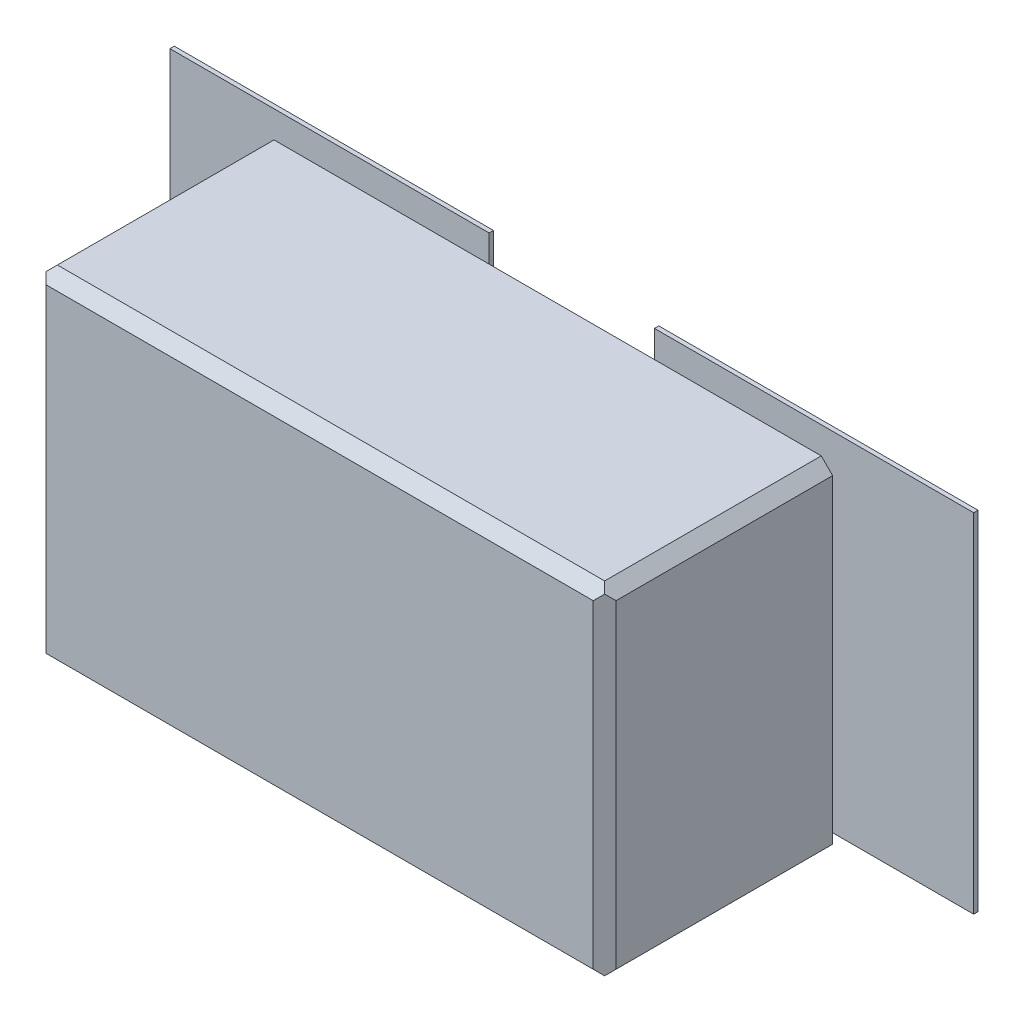
ISO-10303-21;
HEADER;
FILE_DESCRIPTION(('STEP AP214'),'2;1');
FILE_NAME('part.step','',(''),(''),'','','');
FILE_SCHEMA(('AUTOMOTIVE_DESIGN { 1 0 10303 214 1 1 1 1 }'));
ENDSEC;
DATA;
#1=APPLICATION_CONTEXT('core data for automotive mechanical design processes');
#2=APPLICATION_PROTOCOL_DEFINITION('international standard','automotive_design',2000,#1);
#3=PRODUCT_CONTEXT('',#1,'mechanical');
#4=PRODUCT('Part','Part','',(#3));
#5=PRODUCT_RELATED_PRODUCT_CATEGORY('part','',(#4));
#6=PRODUCT_DEFINITION_FORMATION('','',#4);
#7=PRODUCT_DEFINITION_CONTEXT('part definition',#1,'design');
#8=PRODUCT_DEFINITION('design','',#6,#7);
#9=PRODUCT_DEFINITION_SHAPE('','',#8);
#10=(LENGTH_UNIT() NAMED_UNIT(*) SI_UNIT(.MILLI.,.METRE.));
#11=(NAMED_UNIT(*) PLANE_ANGLE_UNIT() SI_UNIT($,.RADIAN.));
#12=(NAMED_UNIT(*) SI_UNIT($,.STERADIAN.) SOLID_ANGLE_UNIT());
#13=UNCERTAINTY_MEASURE_WITH_UNIT(LENGTH_MEASURE(1.E-05),#10,'distance_accuracy_value','');
#14=(GEOMETRIC_REPRESENTATION_CONTEXT(3) GLOBAL_UNCERTAINTY_ASSIGNED_CONTEXT((#13)) GLOBAL_UNIT_ASSIGNED_CONTEXT((#10,
#11,#12)) REPRESENTATION_CONTEXT('',''));
#15=CARTESIAN_POINT('',(0.,0.,0.));
#16=DIRECTION('',(0.,0.,1.));
#17=DIRECTION('',(1.,0.,0.));
#18=AXIS2_PLACEMENT_3D('',#15,#16,#17);
#19=CARTESIAN_POINT('',(-0.49,0.,0.5162));
#20=DIRECTION('',(-0.707106781186548,0.,0.707106781186548));
#21=DIRECTION('',(0.,1.,0.));
#22=AXIS2_PLACEMENT_3D('',#19,#20,#21);
#23=PLANE('',#22);
#24=DIRECTION('',(0.,-1.,0.));
#25=VECTOR('',#24,1.);
#26=CARTESIAN_POINT('',(-0.5,0.28,0.5062));
#27=LINE('',#26,#25);
#28=CARTESIAN_POINT('',(-0.5,0.28,0.5062));
#29=VERTEX_POINT('',#28);
#30=CARTESIAN_POINT('',(-0.5,-0.28,0.5062));
#31=VERTEX_POINT('',#30);
#32=EDGE_CURVE('P0_E428',#29,#31,#27,.T.);
#33=ORIENTED_EDGE('',*,*,#32,.T.);
#34=DIRECTION('',(-0.577350269189626,0.577350269189626,-0.577350269189626));
#35=VECTOR('',#34,1.);
#36=CARTESIAN_POINT('',(-0.49,-0.29,0.5162));
#37=LINE('',#36,#35);
#38=CARTESIAN_POINT('',(-0.49,-0.29,0.5162));
#39=VERTEX_POINT('',#38);
#40=EDGE_CURVE('P0_E274',#39,#31,#37,.T.);
#41=ORIENTED_EDGE('',*,*,#40,.F.);
#42=DIRECTION('',(-0.577350269189626,-0.577350269189626,-0.577350269189626));
#43=VECTOR('',#42,1.);
#44=CARTESIAN_POINT('',(-0.48,-0.28,0.5262));
#45=LINE('',#44,#43);
#46=CARTESIAN_POINT('',(-0.48,-0.28,0.5262));
#47=VERTEX_POINT('',#46);
#48=EDGE_CURVE('P0_E11',#47,#39,#45,.T.);
#49=ORIENTED_EDGE('',*,*,#48,.F.);
#50=DIRECTION('',(0.,-1.,0.));
#51=VECTOR('',#50,1.);
#52=CARTESIAN_POINT('',(-0.48,0.28,0.5262));
#53=LINE('',#52,#51);
#54=CARTESIAN_POINT('',(-0.48,0.28,0.5262));
#55=VERTEX_POINT('',#54);
#56=EDGE_CURVE('P0_E222',#55,#47,#53,.T.);
#57=ORIENTED_EDGE('',*,*,#56,.F.);
#58=DIRECTION('',(0.577350269189626,-0.577350269189626,0.577350269189626));
#59=VECTOR('',#58,1.);
#60=CARTESIAN_POINT('',(-0.49,0.29,0.5162));
#61=LINE('',#60,#59);
#62=CARTESIAN_POINT('',(-0.49,0.29,0.5162));
#63=VERTEX_POINT('',#62);
#64=EDGE_CURVE('P0_E223',#63,#55,#61,.T.);
#65=ORIENTED_EDGE('',*,*,#64,.F.);
#66=DIRECTION('',(0.577350269189626,0.577350269189626,0.577350269189626));
#67=VECTOR('',#66,1.);
#68=CARTESIAN_POINT('',(-0.5,0.28,0.5062));
#69=LINE('',#68,#67);
#70=EDGE_CURVE('P0_E288',#29,#63,#69,.T.);
#71=ORIENTED_EDGE('',*,*,#70,.F.);
#72=EDGE_LOOP('',(#33,#41,#49,#57,#65,#71));
#73=FACE_BOUND('',#72,.T.);
#74=ADVANCED_FACE('P0_F17',(#73),#23,.T.);
#75=CARTESIAN_POINT('',(0.,-0.29,0.5162));
#76=DIRECTION('',(0.,-0.707106781186548,0.707106781186548));
#77=DIRECTION('',(-1.,0.,0.));
#78=AXIS2_PLACEMENT_3D('',#75,#76,#77);
#79=PLANE('',#78);
#80=DIRECTION('',(1.,0.,0.));
#81=VECTOR('',#80,1.);
#82=CARTESIAN_POINT('',(-0.48,-0.3,0.5062));
#83=LINE('',#82,#81);
#84=CARTESIAN_POINT('',(-0.48,-0.3,0.5062));
#85=VERTEX_POINT('',#84);
#86=CARTESIAN_POINT('',(0.48,-0.3,0.5062));
#87=VERTEX_POINT('',#86);
#88=EDGE_CURVE('P0_E247',#85,#87,#83,.T.);
#89=ORIENTED_EDGE('',*,*,#88,.T.);
#90=DIRECTION('',(-0.577350269189626,-0.577350269189626,-0.577350269189626));
#91=VECTOR('',#90,1.);
#92=CARTESIAN_POINT('',(0.49,-0.29,0.5162));
#93=LINE('',#92,#91);
#94=CARTESIAN_POINT('',(0.49,-0.29,0.5162));
#95=VERTEX_POINT('',#94);
#96=EDGE_CURVE('P0_E248',#95,#87,#93,.T.);
#97=ORIENTED_EDGE('',*,*,#96,.F.);
#98=DIRECTION('',(0.577350269189626,-0.577350269189626,-0.577350269189626));
#99=VECTOR('',#98,1.);
#100=CARTESIAN_POINT('',(0.48,-0.28,0.5262));
#101=LINE('',#100,#99);
#102=CARTESIAN_POINT('',(0.48,-0.28,0.5262));
#103=VERTEX_POINT('',#102);
#104=EDGE_CURVE('P0_E28',#103,#95,#101,.T.);
#105=ORIENTED_EDGE('',*,*,#104,.F.);
#106=DIRECTION('',(1.,0.,0.));
#107=VECTOR('',#106,1.);
#108=CARTESIAN_POINT('',(-0.48,-0.28,0.5262));
#109=LINE('',#108,#107);
#110=EDGE_CURVE('P0_E227',#47,#103,#109,.T.);
#111=ORIENTED_EDGE('',*,*,#110,.F.);
#112=ORIENTED_EDGE('',*,*,#48,.T.);
#113=DIRECTION('',(-0.577350269189626,0.577350269189626,0.577350269189626));
#114=VECTOR('',#113,1.);
#115=CARTESIAN_POINT('',(-0.48,-0.3,0.5062));
#116=LINE('',#115,#114);
#117=EDGE_CURVE('P0_E279',#85,#39,#116,.T.);
#118=ORIENTED_EDGE('',*,*,#117,.F.);
#119=EDGE_LOOP('',(#89,#97,#105,#111,#112,#118));
#120=FACE_BOUND('',#119,.T.);
#121=ADVANCED_FACE('P0_F501',(#120),#79,.T.);
#122=CARTESIAN_POINT('',(0.49,0.,0.5162));
#123=DIRECTION('',(0.707106781186548,0.,0.707106781186548));
#124=DIRECTION('',(0.,-1.,0.));
#125=AXIS2_PLACEMENT_3D('',#122,#123,#124);
#126=PLANE('',#125);
#127=DIRECTION('',(0.,1.,0.));
#128=VECTOR('',#127,1.);
#129=CARTESIAN_POINT('',(0.5,-0.28,0.5062));
#130=LINE('',#129,#128);
#131=CARTESIAN_POINT('',(0.5,-0.28,0.5062));
#132=VERTEX_POINT('',#131);
#133=CARTESIAN_POINT('',(0.5,0.28,0.5062));
#134=VERTEX_POINT('',#133);
#135=EDGE_CURVE('P0_E260',#132,#134,#130,.T.);
#136=ORIENTED_EDGE('',*,*,#135,.T.);
#137=DIRECTION('',(0.577350269189626,-0.577350269189626,-0.577350269189626));
#138=VECTOR('',#137,1.);
#139=CARTESIAN_POINT('',(0.49,0.29,0.5162));
#140=LINE('',#139,#138);
#141=CARTESIAN_POINT('',(0.49,0.29,0.5162));
#142=VERTEX_POINT('',#141);
#143=EDGE_CURVE('P0_E258',#142,#134,#140,.T.);
#144=ORIENTED_EDGE('',*,*,#143,.F.);
#145=DIRECTION('',(0.577350269189626,0.577350269189626,-0.577350269189626));
#146=VECTOR('',#145,1.);
#147=CARTESIAN_POINT('',(0.48,0.28,0.5262));
#148=LINE('',#147,#146);
#149=CARTESIAN_POINT('',(0.48,0.28,0.5262));
#150=VERTEX_POINT('',#149);
#151=EDGE_CURVE('P0_E239',#150,#142,#148,.T.);
#152=ORIENTED_EDGE('',*,*,#151,.F.);
#153=DIRECTION('',(0.,1.,0.));
#154=VECTOR('',#153,1.);
#155=CARTESIAN_POINT('',(0.48,-0.28,0.5262));
#156=LINE('',#155,#154);
#157=EDGE_CURVE('P0_E218',#103,#150,#156,.T.);
#158=ORIENTED_EDGE('',*,*,#157,.F.);
#159=ORIENTED_EDGE('',*,*,#104,.T.);
#160=DIRECTION('',(-0.577350269189626,-0.577350269189626,0.577350269189626));
#161=VECTOR('',#160,1.);
#162=CARTESIAN_POINT('',(0.5,-0.28,0.5062));
#163=LINE('',#162,#161);
#164=EDGE_CURVE('P0_E296',#132,#95,#163,.T.);
#165=ORIENTED_EDGE('',*,*,#164,.F.);
#166=EDGE_LOOP('',(#136,#144,#152,#158,#159,#165));
#167=FACE_BOUND('',#166,.T.);
#168=ADVANCED_FACE('P0_F457',(#167),#126,.T.);
#169=CARTESIAN_POINT('',(0.,0.,0.5262));
#170=DIRECTION('',(0.,0.,1.));
#171=DIRECTION('',(1.,0.,0.));
#172=AXIS2_PLACEMENT_3D('',#169,#170,#171);
#173=PLANE('',#172);
#174=ORIENTED_EDGE('',*,*,#157,.T.);
#175=DIRECTION('',(-1.,0.,0.));
#176=VECTOR('',#175,1.);
#177=CARTESIAN_POINT('',(0.48,0.28,0.5262));
#178=LINE('',#177,#176);
#179=EDGE_CURVE('P0_E242',#150,#55,#178,.T.);
#180=ORIENTED_EDGE('',*,*,#179,.T.);
#181=ORIENTED_EDGE('',*,*,#56,.T.);
#182=ORIENTED_EDGE('',*,*,#110,.T.);
#183=EDGE_LOOP('',(#174,#180,#181,#182));
#184=FACE_BOUND('',#183,.T.);
#185=ADVANCED_FACE('P0_F451',(#184),#173,.T.);
#186=CARTESIAN_POINT('',(0.,0.29,0.5162));
#187=DIRECTION('',(0.,0.707106781186548,0.707106781186548));
#188=DIRECTION('',(1.,0.,0.));
#189=AXIS2_PLACEMENT_3D('',#186,#187,#188);
#190=PLANE('',#189);
#191=ORIENTED_EDGE('',*,*,#179,.F.);
#192=ORIENTED_EDGE('',*,*,#151,.T.);
#193=DIRECTION('',(0.577350269189626,-0.577350269189626,0.577350269189626));
#194=VECTOR('',#193,1.);
#195=CARTESIAN_POINT('',(0.48,0.3,0.5062));
#196=LINE('',#195,#194);
#197=CARTESIAN_POINT('',(0.48,0.3,0.5062));
#198=VERTEX_POINT('',#197);
#199=EDGE_CURVE('P0_E254',#198,#142,#196,.T.);
#200=ORIENTED_EDGE('',*,*,#199,.F.);
#201=DIRECTION('',(-1.,0.,0.));
#202=VECTOR('',#201,1.);
#203=CARTESIAN_POINT('',(0.48,0.3,0.5062));
#204=LINE('',#203,#202);
#205=CARTESIAN_POINT('',(-0.48,0.3,0.5062));
#206=VERTEX_POINT('',#205);
#207=EDGE_CURVE('P0_E283',#198,#206,#204,.T.);
#208=ORIENTED_EDGE('',*,*,#207,.T.);
#209=DIRECTION('',(-0.577350269189626,-0.577350269189626,0.577350269189626));
#210=VECTOR('',#209,1.);
#211=CARTESIAN_POINT('',(-0.48,0.3,0.5062));
#212=LINE('',#211,#210);
#213=EDGE_CURVE('P0_E284',#206,#63,#212,.T.);
#214=ORIENTED_EDGE('',*,*,#213,.T.);
#215=ORIENTED_EDGE('',*,*,#64,.T.);
#216=EDGE_LOOP('',(#191,#192,#200,#208,#214,#215));
#217=FACE_BOUND('',#216,.T.);
#218=ADVANCED_FACE('P0_F448',(#217),#190,.T.);
#219=CARTESIAN_POINT('',(0.5,0.3,0.0762));
#220=DIRECTION('',(0.,1.,0.));
#221=DIRECTION('',(1.,0.,0.));
#222=AXIS2_PLACEMENT_3D('',#219,#220,#221);
#223=PLANE('',#222);
#224=DIRECTION('',(0.,0.,-1.));
#225=VECTOR('',#224,1.);
#226=CARTESIAN_POINT('',(0.48,0.3,0.5062));
#227=LINE('',#226,#225);
#228=CARTESIAN_POINT('',(0.48,0.3,0.1262));
#229=VERTEX_POINT('',#228);
#230=EDGE_CURVE('P0_E259',#198,#229,#227,.T.);
#231=ORIENTED_EDGE('',*,*,#230,.T.);
#232=DIRECTION('',(-1.,0.,0.));
#233=VECTOR('',#232,1.);
#234=CARTESIAN_POINT('',(0.48,0.3,0.1262));
#235=LINE('',#234,#233);
#236=CARTESIAN_POINT('',(-0.48,0.3,0.1262));
#237=VERTEX_POINT('',#236);
#238=EDGE_CURVE('P0_E253',#229,#237,#235,.T.);
#239=ORIENTED_EDGE('',*,*,#238,.T.);
#240=DIRECTION('',(0.,0.,-1.));
#241=VECTOR('',#240,1.);
#242=CARTESIAN_POINT('',(-0.48,0.3,0.5062));
#243=LINE('',#242,#241);
#244=EDGE_CURVE('P0_E280',#206,#237,#243,.T.);
#245=ORIENTED_EDGE('',*,*,#244,.F.);
#246=ORIENTED_EDGE('',*,*,#207,.F.);
#247=EDGE_LOOP('',(#231,#239,#245,#246));
#248=FACE_BOUND('',#247,.T.);
#249=ADVANCED_FACE('P0_F464',(#248),#223,.T.);
#250=CARTESIAN_POINT('',(-0.49,0.29,0.3262));
#251=DIRECTION('',(-0.707106781186548,0.707106781186548,0.));
#252=DIRECTION('',(0.,0.,1.));
#253=AXIS2_PLACEMENT_3D('',#250,#251,#252);
#254=PLANE('',#253);
#255=DIRECTION('',(0.707106781186548,0.707106781186548,0.));
#256=VECTOR('',#255,1.);
#257=CARTESIAN_POINT('',(-0.5,0.28,0.1262));
#258=LINE('',#257,#256);
#259=CARTESIAN_POINT('',(-0.5,0.28,0.1262));
#260=VERTEX_POINT('',#259);
#261=EDGE_CURVE('P0_E422',#260,#237,#258,.T.);
#262=ORIENTED_EDGE('',*,*,#261,.F.);
#263=DIRECTION('',(0.,0.,-1.));
#264=VECTOR('',#263,1.);
#265=CARTESIAN_POINT('',(-0.5,0.28,0.5062));
#266=LINE('',#265,#264);
#267=EDGE_CURVE('P0_E292',#29,#260,#266,.T.);
#268=ORIENTED_EDGE('',*,*,#267,.F.);
#269=ORIENTED_EDGE('',*,*,#70,.T.);
#270=ORIENTED_EDGE('',*,*,#213,.F.);
#271=ORIENTED_EDGE('',*,*,#244,.T.);
#272=EDGE_LOOP('',(#262,#268,#269,#270,#271));
#273=FACE_BOUND('',#272,.T.);
#274=ADVANCED_FACE('P0_F686',(#273),#254,.T.);
#275=CARTESIAN_POINT('',(-0.5,0.3,0.0762));
#276=DIRECTION('',(-1.,0.,0.));
#277=DIRECTION('',(0.,0.,1.));
#278=AXIS2_PLACEMENT_3D('',#275,#276,#277);
#279=PLANE('',#278);
#280=DIRECTION('',(0.,0.,-1.));
#281=VECTOR('',#280,1.);
#282=CARTESIAN_POINT('',(-0.5,-0.28,0.5062));
#283=LINE('',#282,#281);
#284=CARTESIAN_POINT('',(-0.5,-0.28,0.1262));
#285=VERTEX_POINT('',#284);
#286=EDGE_CURVE('P0_E278',#31,#285,#283,.T.);
#287=ORIENTED_EDGE('',*,*,#286,.F.);
#288=ORIENTED_EDGE('',*,*,#32,.F.);
#289=ORIENTED_EDGE('',*,*,#267,.T.);
#290=DIRECTION('',(0.,-1.,0.));
#291=VECTOR('',#290,1.);
#292=CARTESIAN_POINT('',(-0.5,0.28,0.1262));
#293=LINE('',#292,#291);
#294=EDGE_CURVE('P0_E470',#260,#285,#293,.T.);
#295=ORIENTED_EDGE('',*,*,#294,.T.);
#296=EDGE_LOOP('',(#287,#288,#289,#295));
#297=FACE_BOUND('',#296,.T.);
#298=ADVANCED_FACE('P0_F531',(#297),#279,.T.);
#299=CARTESIAN_POINT('',(-0.49,-0.29,0.3262));
#300=DIRECTION('',(-0.707106781186548,-0.707106781186548,0.));
#301=DIRECTION('',(-0.707106781186548,0.707106781186548,0.));
#302=AXIS2_PLACEMENT_3D('',#299,#300,#301);
#303=PLANE('',#302);
#304=DIRECTION('',(-0.707106781186548,0.707106781186548,0.));
#305=VECTOR('',#304,1.);
#306=CARTESIAN_POINT('',(-0.48,-0.3,0.1262));
#307=LINE('',#306,#305);
#308=CARTESIAN_POINT('',(-0.48,-0.3,0.1262));
#309=VERTEX_POINT('',#308);
#310=EDGE_CURVE('P0_E431',#309,#285,#307,.T.);
#311=ORIENTED_EDGE('',*,*,#310,.F.);
#312=DIRECTION('',(0.,0.,-1.));
#313=VECTOR('',#312,1.);
#314=CARTESIAN_POINT('',(-0.48,-0.3,0.5062));
#315=LINE('',#314,#313);
#316=EDGE_CURVE('P0_E317',#85,#309,#315,.T.);
#317=ORIENTED_EDGE('',*,*,#316,.F.);
#318=ORIENTED_EDGE('',*,*,#117,.T.);
#319=ORIENTED_EDGE('',*,*,#40,.T.);
#320=ORIENTED_EDGE('',*,*,#286,.T.);
#321=EDGE_LOOP('',(#311,#317,#318,#319,#320));
#322=FACE_BOUND('',#321,.T.);
#323=ADVANCED_FACE('P0_F19',(#322),#303,.T.);
#324=CARTESIAN_POINT('',(-0.5,-0.3,0.0762));
#325=DIRECTION('',(0.,-1.,0.));
#326=DIRECTION('',(0.,0.,-1.));
#327=AXIS2_PLACEMENT_3D('',#324,#325,#326);
#328=PLANE('',#327);
#329=DIRECTION('',(0.,0.,-1.));
#330=VECTOR('',#329,1.);
#331=CARTESIAN_POINT('',(0.48,-0.3,0.5062));
#332=LINE('',#331,#330);
#333=CARTESIAN_POINT('',(0.48,-0.3,0.1262));
#334=VERTEX_POINT('',#333);
#335=EDGE_CURVE('P0_E243',#87,#334,#332,.T.);
#336=ORIENTED_EDGE('',*,*,#335,.F.);
#337=ORIENTED_EDGE('',*,*,#88,.F.);
#338=ORIENTED_EDGE('',*,*,#316,.T.);
#339=DIRECTION('',(1.,0.,0.));
#340=VECTOR('',#339,1.);
#341=CARTESIAN_POINT('',(-0.48,-0.3,0.1262));
#342=LINE('',#341,#340);
#343=EDGE_CURVE('P0_E357',#309,#334,#342,.T.);
#344=ORIENTED_EDGE('',*,*,#343,.T.);
#345=EDGE_LOOP('',(#336,#337,#338,#344));
#346=FACE_BOUND('',#345,.T.);
#347=ADVANCED_FACE('P0_F506',(#346),#328,.T.);
#348=CARTESIAN_POINT('',(0.49,-0.29,0.3262));
#349=DIRECTION('',(0.707106781186548,-0.707106781186548,0.));
#350=DIRECTION('',(0.,0.,-1.));
#351=AXIS2_PLACEMENT_3D('',#348,#349,#350);
#352=PLANE('',#351);
#353=DIRECTION('',(-0.707106781186548,-0.707106781186548,0.));
#354=VECTOR('',#353,1.);
#355=CARTESIAN_POINT('',(0.5,-0.28,0.1262));
#356=LINE('',#355,#354);
#357=CARTESIAN_POINT('',(0.5,-0.28,0.1262));
#358=VERTEX_POINT('',#357);
#359=EDGE_CURVE('P0_E335',#358,#334,#356,.T.);
#360=ORIENTED_EDGE('',*,*,#359,.F.);
#361=DIRECTION('',(0.,0.,-1.));
#362=VECTOR('',#361,1.);
#363=CARTESIAN_POINT('',(0.5,-0.28,0.5062));
#364=LINE('',#363,#362);
#365=EDGE_CURVE('P0_E263',#132,#358,#364,.T.);
#366=ORIENTED_EDGE('',*,*,#365,.F.);
#367=ORIENTED_EDGE('',*,*,#164,.T.);
#368=ORIENTED_EDGE('',*,*,#96,.T.);
#369=ORIENTED_EDGE('',*,*,#335,.T.);
#370=EDGE_LOOP('',(#360,#366,#367,#368,#369));
#371=FACE_BOUND('',#370,.T.);
#372=ADVANCED_FACE('P0_F494',(#371),#352,.T.);
#373=CARTESIAN_POINT('',(0.5,-0.3,0.0762));
#374=DIRECTION('',(1.,0.,0.));
#375=DIRECTION('',(0.,1.,0.));
#376=AXIS2_PLACEMENT_3D('',#373,#374,#375);
#377=PLANE('',#376);
#378=DIRECTION('',(0.,0.,-1.));
#379=VECTOR('',#378,1.);
#380=CARTESIAN_POINT('',(0.5,0.28,0.5062));
#381=LINE('',#380,#379);
#382=CARTESIAN_POINT('',(0.5,0.28,0.1262));
#383=VERTEX_POINT('',#382);
#384=EDGE_CURVE('P0_E264',#134,#383,#381,.T.);
#385=ORIENTED_EDGE('',*,*,#384,.F.);
#386=ORIENTED_EDGE('',*,*,#135,.F.);
#387=ORIENTED_EDGE('',*,*,#365,.T.);
#388=DIRECTION('',(0.,1.,0.));
#389=VECTOR('',#388,1.);
#390=CARTESIAN_POINT('',(0.5,-0.28,0.1262));
#391=LINE('',#390,#389);
#392=EDGE_CURVE('P0_E326',#358,#383,#391,.T.);
#393=ORIENTED_EDGE('',*,*,#392,.T.);
#394=EDGE_LOOP('',(#385,#386,#387,#393));
#395=FACE_BOUND('',#394,.T.);
#396=ADVANCED_FACE('P0_F572',(#395),#377,.T.);
#397=CARTESIAN_POINT('',(0.49,0.29,0.3262));
#398=DIRECTION('',(0.707106781186548,0.707106781186548,0.));
#399=DIRECTION('',(0.,0.,-1.));
#400=AXIS2_PLACEMENT_3D('',#397,#398,#399);
#401=PLANE('',#400);
#402=DIRECTION('',(0.707106781186548,-0.707106781186548,0.));
#403=VECTOR('',#402,1.);
#404=CARTESIAN_POINT('',(0.48,0.3,0.1262));
#405=LINE('',#404,#403);
#406=EDGE_CURVE('P0_E323',#229,#383,#405,.T.);
#407=ORIENTED_EDGE('',*,*,#406,.F.);
#408=ORIENTED_EDGE('',*,*,#230,.F.);
#409=ORIENTED_EDGE('',*,*,#199,.T.);
#410=ORIENTED_EDGE('',*,*,#143,.T.);
#411=ORIENTED_EDGE('',*,*,#384,.T.);
#412=EDGE_LOOP('',(#407,#408,#409,#410,#411));
#413=FACE_BOUND('',#412,.T.);
#414=ADVANCED_FACE('P0_F462',(#413),#401,.T.);
#415=CARTESIAN_POINT('',(-0.4659973957868,-0.25,0.1262));
#416=DIRECTION('',(-1.,0.,0.));
#417=DIRECTION('',(0.,0.,1.));
#418=AXIS2_PLACEMENT_3D('',#415,#416,#417);
#419=PLANE('',#418);
#420=DIRECTION('',(0.,1.,0.));
#421=VECTOR('',#420,1.);
#422=CARTESIAN_POINT('',(-0.4659973957868,-0.25,0.1262));
#423=LINE('',#422,#421);
#424=CARTESIAN_POINT('',(-0.4659973957868,-0.25,0.1262));
#425=VERTEX_POINT('',#424);
#426=CARTESIAN_POINT('',(-0.4659973957868,0.2,0.1262));
#427=VERTEX_POINT('',#426);
#428=EDGE_CURVE('P0_E181',#425,#427,#423,.T.);
#429=ORIENTED_EDGE('',*,*,#428,.T.);
#430=DIRECTION('',(0.,0.,-1.));
#431=VECTOR('',#430,1.);
#432=CARTESIAN_POINT('',(-0.4659973957868,0.2,0.1262));
#433=LINE('',#432,#431);
#434=CARTESIAN_POINT('',(-0.4659973957868,0.2,0.0862));
#435=VERTEX_POINT('',#434);
#436=EDGE_CURVE('P0_E302',#427,#435,#433,.T.);
#437=ORIENTED_EDGE('',*,*,#436,.T.);
#438=DIRECTION('',(0.,1.,0.));
#439=VECTOR('',#438,1.);
#440=CARTESIAN_POINT('',(-0.4659973957868,-0.25,0.0862));
#441=LINE('',#440,#439);
#442=CARTESIAN_POINT('',(-0.4659973957868,-0.25,0.0862));
#443=VERTEX_POINT('',#442);
#444=EDGE_CURVE('P0_E199',#443,#435,#441,.T.);
#445=ORIENTED_EDGE('',*,*,#444,.F.);
#446=DIRECTION('',(0.,0.,-1.));
#447=VECTOR('',#446,1.);
#448=CARTESIAN_POINT('',(-0.4659973957868,-0.25,0.1262));
#449=LINE('',#448,#447);
#450=EDGE_CURVE('P0_E196',#425,#443,#449,.T.);
#451=ORIENTED_EDGE('',*,*,#450,.F.);
#452=EDGE_LOOP('',(#429,#437,#445,#451));
#453=FACE_BOUND('',#452,.T.);
#454=ADVANCED_FACE('P0_F197',(#453),#419,.T.);
#455=CARTESIAN_POINT('',(-0.4659973957868,0.25,0.1262));
#456=DIRECTION('',(0.,0.,-1.));
#457=DIRECTION('',(-1.,0.,0.));
#458=AXIS2_PLACEMENT_3D('',#455,#456,#457);
#459=CYLINDRICAL_SURFACE('',#458,0.05);
#460=CARTESIAN_POINT('',(-0.4659973957868,0.25,0.1262));
#461=DIRECTION('',(0.,0.,-1.));
#462=DIRECTION('',(1.,0.,0.));
#463=AXIS2_PLACEMENT_3D('',#460,#461,#462);
#464=CIRCLE('',#463,0.05);
#465=CARTESIAN_POINT('',(-0.4159973957868,0.25,0.1262));
#466=VERTEX_POINT('',#465);
#467=EDGE_CURVE('P0_E190',#466,#427,#464,.T.);
#468=ORIENTED_EDGE('',*,*,#467,.F.);
#469=DIRECTION('',(0.,0.,-1.));
#470=VECTOR('',#469,1.);
#471=CARTESIAN_POINT('',(-0.4159973957868,0.25,0.1262));
#472=LINE('',#471,#470);
#473=CARTESIAN_POINT('',(-0.4159973957868,0.25,0.0862));
#474=VERTEX_POINT('',#473);
#475=EDGE_CURVE('P0_E305',#466,#474,#472,.T.);
#476=ORIENTED_EDGE('',*,*,#475,.T.);
#477=CARTESIAN_POINT('',(-0.4659973957868,0.25,0.0862));
#478=DIRECTION('',(0.,0.,1.));
#479=DIRECTION('',(0.,-1.,0.));
#480=AXIS2_PLACEMENT_3D('',#477,#478,#479);
#481=CIRCLE('',#480,0.05);
#482=EDGE_CURVE('P0_E234',#435,#474,#481,.T.);
#483=ORIENTED_EDGE('',*,*,#482,.F.);
#484=ORIENTED_EDGE('',*,*,#436,.F.);
#485=EDGE_LOOP('',(#468,#476,#483,#484));
#486=FACE_BOUND('',#485,.T.);
#487=ADVANCED_FACE('P0_F543',(#486),#459,.F.);
#488=CARTESIAN_POINT('',(-0.4159973957868,0.25,0.1262));
#489=DIRECTION('',(0.,1.,0.));
#490=DIRECTION('',(1.,0.,0.));
#491=AXIS2_PLACEMENT_3D('',#488,#489,#490);
#492=PLANE('',#491);
#493=DIRECTION('',(1.,0.,0.));
#494=VECTOR('',#493,1.);
#495=CARTESIAN_POINT('',(-0.4159973957868,0.25,0.1262));
#496=LINE('',#495,#494);
#497=CARTESIAN_POINT('',(-0.2159973957868,0.25,0.1262));
#498=VERTEX_POINT('',#497);
#499=EDGE_CURVE('P0_E252',#466,#498,#496,.T.);
#500=ORIENTED_EDGE('',*,*,#499,.T.);
#501=DIRECTION('',(0.,0.,-1.));
#502=VECTOR('',#501,1.);
#503=CARTESIAN_POINT('',(-0.2159973957868,0.25,0.1262));
#504=LINE('',#503,#502);
#505=CARTESIAN_POINT('',(-0.2159973957868,0.25,0.0862));
#506=VERTEX_POINT('',#505);
#507=EDGE_CURVE('P0_E367',#498,#506,#504,.T.);
#508=ORIENTED_EDGE('',*,*,#507,.T.);
#509=DIRECTION('',(1.,0.,0.));
#510=VECTOR('',#509,1.);
#511=CARTESIAN_POINT('',(-0.4159973957868,0.25,0.0862));
#512=LINE('',#511,#510);
#513=EDGE_CURVE('P0_E238',#474,#506,#512,.T.);
#514=ORIENTED_EDGE('',*,*,#513,.F.);
#515=ORIENTED_EDGE('',*,*,#475,.F.);
#516=EDGE_LOOP('',(#500,#508,#514,#515));
#517=FACE_BOUND('',#516,.T.);
#518=ADVANCED_FACE('P0_F537',(#517),#492,.T.);
#519=CARTESIAN_POINT('',(-0.2159973957868,0.25,0.1262));
#520=DIRECTION('',(1.,0.,0.));
#521=DIRECTION('',(0.,1.,0.));
#522=AXIS2_PLACEMENT_3D('',#519,#520,#521);
#523=PLANE('',#522);
#524=DIRECTION('',(0.,-1.,0.));
#525=VECTOR('',#524,1.);
#526=CARTESIAN_POINT('',(-0.2159973957868,0.25,0.1262));
#527=LINE('',#526,#525);
#528=CARTESIAN_POINT('',(-0.2159973957868,-0.25,0.1262));
#529=VERTEX_POINT('',#528);
#530=EDGE_CURVE('P0_E249',#498,#529,#527,.T.);
#531=ORIENTED_EDGE('',*,*,#530,.T.);
#532=DIRECTION('',(0.,0.,-1.));
#533=VECTOR('',#532,1.);
#534=CARTESIAN_POINT('',(-0.2159973957868,-0.25,0.1262));
#535=LINE('',#534,#533);
#536=CARTESIAN_POINT('',(-0.2159973957868,-0.25,0.0862));
#537=VERTEX_POINT('',#536);
#538=EDGE_CURVE('P0_E209',#529,#537,#535,.T.);
#539=ORIENTED_EDGE('',*,*,#538,.T.);
#540=DIRECTION('',(0.,-1.,0.));
#541=VECTOR('',#540,1.);
#542=CARTESIAN_POINT('',(-0.2159973957868,0.25,0.0862));
#543=LINE('',#542,#541);
#544=EDGE_CURVE('P0_E285',#506,#537,#543,.T.);
#545=ORIENTED_EDGE('',*,*,#544,.F.);
#546=ORIENTED_EDGE('',*,*,#507,.F.);
#547=EDGE_LOOP('',(#531,#539,#545,#546));
#548=FACE_BOUND('',#547,.T.);
#549=ADVANCED_FACE('P0_F542',(#548),#523,.T.);
#550=CARTESIAN_POINT('',(0.,0.,0.0862));
#551=DIRECTION('',(0.,0.,-1.));
#552=DIRECTION('',(0.,-1.,0.));
#553=AXIS2_PLACEMENT_3D('',#550,#551,#552);
#554=PLANE('',#553);
#555=ORIENTED_EDGE('',*,*,#544,.T.);
#556=DIRECTION('',(-1.,0.,0.));
#557=VECTOR('',#556,1.);
#558=CARTESIAN_POINT('',(-0.2159973957868,-0.25,0.0862));
#559=LINE('',#558,#557);
#560=EDGE_CURVE('P0_E204',#537,#443,#559,.T.);
#561=ORIENTED_EDGE('',*,*,#560,.T.);
#562=ORIENTED_EDGE('',*,*,#444,.T.);
#563=ORIENTED_EDGE('',*,*,#482,.T.);
#564=ORIENTED_EDGE('',*,*,#513,.T.);
#565=EDGE_LOOP('',(#555,#561,#562,#563,#564));
#566=FACE_BOUND('',#565,.T.);
#567=ADVANCED_FACE('P0_F548',(#566),#554,.T.);
#568=CARTESIAN_POINT('',(0.,0.,0.0862));
#569=DIRECTION('',(0.,0.,-1.));
#570=DIRECTION('',(0.,-1.,0.));
#571=AXIS2_PLACEMENT_3D('',#568,#569,#570);
#572=PLANE('',#571);
#573=DIRECTION('',(0.,-1.,0.));
#574=VECTOR('',#573,1.);
#575=CARTESIAN_POINT('',(0.4340026042132,0.25,0.0862));
#576=LINE('',#575,#574);
#577=CARTESIAN_POINT('',(0.4340026042132,0.25,0.0862));
#578=VERTEX_POINT('',#577);
#579=CARTESIAN_POINT('',(0.4340026042132,-0.25,0.0862));
#580=VERTEX_POINT('',#579);
#581=EDGE_CURVE('P0_E272',#578,#580,#576,.T.);
#582=ORIENTED_EDGE('',*,*,#581,.T.);
#583=DIRECTION('',(-1.,0.,0.));
#584=VECTOR('',#583,1.);
#585=CARTESIAN_POINT('',(0.4340026042132,-0.25,0.0862));
#586=LINE('',#585,#584);
#587=CARTESIAN_POINT('',(0.1840026042132,-0.25,0.0862));
#588=VERTEX_POINT('',#587);
#589=EDGE_CURVE('P0_E232',#580,#588,#586,.T.);
#590=ORIENTED_EDGE('',*,*,#589,.T.);
#591=DIRECTION('',(0.,1.,0.));
#592=VECTOR('',#591,1.);
#593=CARTESIAN_POINT('',(0.1840026042132,-0.25,0.0862));
#594=LINE('',#593,#592);
#595=CARTESIAN_POINT('',(0.1840026042132,0.25,0.0862));
#596=VERTEX_POINT('',#595);
#597=EDGE_CURVE('P0_E233',#588,#596,#594,.T.);
#598=ORIENTED_EDGE('',*,*,#597,.T.);
#599=DIRECTION('',(1.,0.,0.));
#600=VECTOR('',#599,1.);
#601=CARTESIAN_POINT('',(0.1840026042132,0.25,0.0862));
#602=LINE('',#601,#600);
#603=EDGE_CURVE('P0_E361',#596,#578,#602,.T.);
#604=ORIENTED_EDGE('',*,*,#603,.T.);
#605=EDGE_LOOP('',(#582,#590,#598,#604));
#606=FACE_BOUND('',#605,.T.);
#607=ADVANCED_FACE('P0_F553',(#606),#572,.T.);
#608=CARTESIAN_POINT('',(0.4340026042132,-0.25,0.1262));
#609=DIRECTION('',(0.,-1.,0.));
#610=DIRECTION('',(0.,0.,-1.));
#611=AXIS2_PLACEMENT_3D('',#608,#609,#610);
#612=PLANE('',#611);
#613=DIRECTION('',(-1.,0.,0.));
#614=VECTOR('',#613,1.);
#615=CARTESIAN_POINT('',(0.4340026042132,-0.25,0.1262));
#616=LINE('',#615,#614);
#617=CARTESIAN_POINT('',(0.4340026042132,-0.25,0.1262));
#618=VERTEX_POINT('',#617);
#619=CARTESIAN_POINT('',(0.1840026042132,-0.25,0.1262));
#620=VERTEX_POINT('',#619);
#621=EDGE_CURVE('P0_E273',#618,#620,#616,.T.);
#622=ORIENTED_EDGE('',*,*,#621,.T.);
#623=DIRECTION('',(0.,0.,-1.));
#624=VECTOR('',#623,1.);
#625=CARTESIAN_POINT('',(0.1840026042132,-0.25,0.1262));
#626=LINE('',#625,#624);
#627=EDGE_CURVE('P0_E228',#620,#588,#626,.T.);
#628=ORIENTED_EDGE('',*,*,#627,.T.);
#629=ORIENTED_EDGE('',*,*,#589,.F.);
#630=DIRECTION('',(0.,0.,-1.));
#631=VECTOR('',#630,1.);
#632=CARTESIAN_POINT('',(0.4340026042132,-0.25,0.1262));
#633=LINE('',#632,#631);
#634=EDGE_CURVE('P0_E268',#618,#580,#633,.T.);
#635=ORIENTED_EDGE('',*,*,#634,.F.);
#636=EDGE_LOOP('',(#622,#628,#629,#635));
#637=FACE_BOUND('',#636,.T.);
#638=ADVANCED_FACE('P0_F562',(#637),#612,.T.);
#639=CARTESIAN_POINT('',(0.1840026042132,-0.25,0.1262));
#640=DIRECTION('',(-1.,0.,0.));
#641=DIRECTION('',(0.,0.,1.));
#642=AXIS2_PLACEMENT_3D('',#639,#640,#641);
#643=PLANE('',#642);
#644=DIRECTION('',(0.,1.,0.));
#645=VECTOR('',#644,1.);
#646=CARTESIAN_POINT('',(0.1840026042132,-0.25,0.1262));
#647=LINE('',#646,#645);
#648=CARTESIAN_POINT('',(0.1840026042132,0.25,0.1262));
#649=VERTEX_POINT('',#648);
#650=EDGE_CURVE('P0_E353',#620,#649,#647,.T.);
#651=ORIENTED_EDGE('',*,*,#650,.T.);
#652=DIRECTION('',(0.,0.,-1.));
#653=VECTOR('',#652,1.);
#654=CARTESIAN_POINT('',(0.1840026042132,0.25,0.1262));
#655=LINE('',#654,#653);
#656=EDGE_CURVE('P0_E267',#649,#596,#655,.T.);
#657=ORIENTED_EDGE('',*,*,#656,.T.);
#658=ORIENTED_EDGE('',*,*,#597,.F.);
#659=ORIENTED_EDGE('',*,*,#627,.F.);
#660=EDGE_LOOP('',(#651,#657,#658,#659));
#661=FACE_BOUND('',#660,.T.);
#662=ADVANCED_FACE('P0_F624',(#661),#643,.T.);
#663=CARTESIAN_POINT('',(0.1840026042132,0.25,0.1262));
#664=DIRECTION('',(0.,1.,0.));
#665=DIRECTION('',(1.,0.,0.));
#666=AXIS2_PLACEMENT_3D('',#663,#664,#665);
#667=PLANE('',#666);
#668=DIRECTION('',(1.,0.,0.));
#669=VECTOR('',#668,1.);
#670=CARTESIAN_POINT('',(0.1840026042132,0.25,0.1262));
#671=LINE('',#670,#669);
#672=CARTESIAN_POINT('',(0.4340026042132,0.25,0.1262));
#673=VERTEX_POINT('',#672);
#674=EDGE_CURVE('P0_E21',#649,#673,#671,.T.);
#675=ORIENTED_EDGE('',*,*,#674,.T.);
#676=DIRECTION('',(0.,0.,-1.));
#677=VECTOR('',#676,1.);
#678=CARTESIAN_POINT('',(0.4340026042132,0.25,0.1262));
#679=LINE('',#678,#677);
#680=EDGE_CURVE('P0_E403',#673,#578,#679,.T.);
#681=ORIENTED_EDGE('',*,*,#680,.T.);
#682=ORIENTED_EDGE('',*,*,#603,.F.);
#683=ORIENTED_EDGE('',*,*,#656,.F.);
#684=EDGE_LOOP('',(#675,#681,#682,#683));
#685=FACE_BOUND('',#684,.T.);
#686=ADVANCED_FACE('P0_F400',(#685),#667,.T.);
#687=CARTESIAN_POINT('',(0.4340026042132,0.25,0.1262));
#688=DIRECTION('',(1.,0.,0.));
#689=DIRECTION('',(0.,1.,0.));
#690=AXIS2_PLACEMENT_3D('',#687,#688,#689);
#691=PLANE('',#690);
#692=DIRECTION('',(0.,-1.,0.));
#693=VECTOR('',#692,1.);
#694=CARTESIAN_POINT('',(0.4340026042132,0.25,0.1262));
#695=LINE('',#694,#693);
#696=EDGE_CURVE('P0_E193',#673,#618,#695,.T.);
#697=ORIENTED_EDGE('',*,*,#696,.T.);
#698=ORIENTED_EDGE('',*,*,#634,.T.);
#699=ORIENTED_EDGE('',*,*,#581,.F.);
#700=ORIENTED_EDGE('',*,*,#680,.F.);
#701=EDGE_LOOP('',(#697,#698,#699,#700));
#702=FACE_BOUND('',#701,.T.);
#703=ADVANCED_FACE('P0_F410',(#702),#691,.T.);
#704=CARTESIAN_POINT('',(0.,0.,0.1262));
#705=DIRECTION('',(0.,0.,1.));
#706=DIRECTION('',(1.,0.,0.));
#707=AXIS2_PLACEMENT_3D('',#704,#705,#706);
#708=PLANE('',#707);
#709=ORIENTED_EDGE('',*,*,#696,.F.);
#710=ORIENTED_EDGE('',*,*,#674,.F.);
#711=ORIENTED_EDGE('',*,*,#650,.F.);
#712=ORIENTED_EDGE('',*,*,#621,.F.);
#713=EDGE_LOOP('',(#709,#710,#711,#712));
#714=FACE_BOUND('',#713,.T.);
#715=ORIENTED_EDGE('',*,*,#530,.F.);
#716=ORIENTED_EDGE('',*,*,#499,.F.);
#717=ORIENTED_EDGE('',*,*,#467,.T.);
#718=ORIENTED_EDGE('',*,*,#428,.F.);
#719=DIRECTION('',(-1.,0.,0.));
#720=VECTOR('',#719,1.);
#721=CARTESIAN_POINT('',(-0.2159973957868,-0.25,0.1262));
#722=LINE('',#721,#720);
#723=EDGE_CURVE('P0_E187',#529,#425,#722,.T.);
#724=ORIENTED_EDGE('',*,*,#723,.F.);
#725=EDGE_LOOP('',(#715,#716,#717,#718,#724));
#726=FACE_BOUND('',#725,.T.);
#727=ORIENTED_EDGE('',*,*,#406,.T.);
#728=ORIENTED_EDGE('',*,*,#392,.F.);
#729=ORIENTED_EDGE('',*,*,#359,.T.);
#730=ORIENTED_EDGE('',*,*,#343,.F.);
#731=ORIENTED_EDGE('',*,*,#310,.T.);
#732=ORIENTED_EDGE('',*,*,#294,.F.);
#733=ORIENTED_EDGE('',*,*,#261,.T.);
#734=ORIENTED_EDGE('',*,*,#238,.F.);
#735=EDGE_LOOP('',(#727,#728,#729,#730,#731,#732,#733,#734));
#736=FACE_BOUND('',#735,.T.);
#737=ADVANCED_FACE('P0_F184',(#714,#726,#736),#708,.F.);
#738=CARTESIAN_POINT('',(-0.2159973957868,-0.25,0.1262));
#739=DIRECTION('',(0.,-1.,0.));
#740=DIRECTION('',(0.,0.,-1.));
#741=AXIS2_PLACEMENT_3D('',#738,#739,#740);
#742=PLANE('',#741);
#743=ORIENTED_EDGE('',*,*,#723,.T.);
#744=ORIENTED_EDGE('',*,*,#450,.T.);
#745=ORIENTED_EDGE('',*,*,#560,.F.);
#746=ORIENTED_EDGE('',*,*,#538,.F.);
#747=EDGE_LOOP('',(#743,#744,#745,#746));
#748=FACE_BOUND('',#747,.T.);
#749=ADVANCED_FACE('P0_F207',(#748),#742,.T.);
#750=CLOSED_SHELL('',(#74,#121,#168,#185,#218,#249,#274,#298,#323,#347,#372,#396,#414,#454,#487,
#518,#549,#567,#607,#638,#662,#686,#703,#737,#749));
#751=MANIFOLD_SOLID_BREP('P0_B1',#750);
#752=CARTESIAN_POINT('',(0.,0.,0.08382));
#753=DIRECTION('',(0.,0.,1.));
#754=DIRECTION('',(1.,0.,0.));
#755=AXIS2_PLACEMENT_3D('',#752,#753,#754);
#756=PLANE('',#755);
#757=DIRECTION('',(1.,0.,0.));
#758=VECTOR('',#757,1.);
#759=CARTESIAN_POINT('',(-0.705,-0.305,0.08382));
#760=LINE('',#759,#758);
#761=CARTESIAN_POINT('',(-0.705,-0.305,0.08382));
#762=VERTEX_POINT('',#761);
#763=CARTESIAN_POINT('',(-0.145,-0.305,0.08382));
#764=VERTEX_POINT('',#763);
#765=EDGE_CURVE('P1_E74',#762,#764,#760,.T.);
#766=ORIENTED_EDGE('',*,*,#765,.T.);
#767=DIRECTION('',(0.,1.,0.));
#768=VECTOR('',#767,1.);
#769=CARTESIAN_POINT('',(-0.145,-0.305,0.08382));
#770=LINE('',#769,#768);
#771=CARTESIAN_POINT('',(-0.145,0.305,0.08382));
#772=VERTEX_POINT('',#771);
#773=EDGE_CURVE('P1_E11',#764,#772,#770,.T.);
#774=ORIENTED_EDGE('',*,*,#773,.T.);
#775=DIRECTION('',(-1.,0.,0.));
#776=VECTOR('',#775,1.);
#777=CARTESIAN_POINT('',(-0.145,0.305,0.08382));
#778=LINE('',#777,#776);
#779=CARTESIAN_POINT('',(-0.705,0.305,0.08382));
#780=VERTEX_POINT('',#779);
#781=EDGE_CURVE('P1_E95',#772,#780,#778,.T.);
#782=ORIENTED_EDGE('',*,*,#781,.T.);
#783=DIRECTION('',(0.,-1.,0.));
#784=VECTOR('',#783,1.);
#785=CARTESIAN_POINT('',(-0.705,0.305,0.08382));
#786=LINE('',#785,#784);
#787=EDGE_CURVE('P1_E20',#780,#762,#786,.T.);
#788=ORIENTED_EDGE('',*,*,#787,.T.);
#789=EDGE_LOOP('',(#766,#774,#782,#788));
#790=FACE_BOUND('',#789,.T.);
#791=ADVANCED_FACE('P1_F17',(#790),#756,.T.);
#792=CARTESIAN_POINT('',(-0.145,-0.305,0.0762));
#793=DIRECTION('',(1.,0.,0.));
#794=DIRECTION('',(0.,1.,0.));
#795=AXIS2_PLACEMENT_3D('',#792,#793,#794);
#796=PLANE('',#795);
#797=DIRECTION('',(0.,1.,0.));
#798=VECTOR('',#797,1.);
#799=CARTESIAN_POINT('',(-0.145,-0.305,0.0762));
#800=LINE('',#799,#798);
#801=CARTESIAN_POINT('',(-0.145,-0.305,0.0762));
#802=VERTEX_POINT('',#801);
#803=CARTESIAN_POINT('',(-0.145,0.305,0.0762));
#804=VERTEX_POINT('',#803);
#805=EDGE_CURVE('P1_E86',#802,#804,#800,.T.);
#806=ORIENTED_EDGE('',*,*,#805,.T.);
#807=DIRECTION('',(0.,0.,1.));
#808=VECTOR('',#807,1.);
#809=CARTESIAN_POINT('',(-0.145,0.305,0.0762));
#810=LINE('',#809,#808);
#811=EDGE_CURVE('P1_E27',#804,#772,#810,.T.);
#812=ORIENTED_EDGE('',*,*,#811,.T.);
#813=ORIENTED_EDGE('',*,*,#773,.F.);
#814=DIRECTION('',(0.,0.,1.));
#815=VECTOR('',#814,1.);
#816=CARTESIAN_POINT('',(-0.145,-0.305,0.0762));
#817=LINE('',#816,#815);
#818=EDGE_CURVE('P1_E71',#802,#764,#817,.T.);
#819=ORIENTED_EDGE('',*,*,#818,.F.);
#820=EDGE_LOOP('',(#806,#812,#813,#819));
#821=FACE_BOUND('',#820,.T.);
#822=ADVANCED_FACE('P1_F69',(#821),#796,.T.);
#823=CARTESIAN_POINT('',(-0.145,0.305,0.0762));
#824=DIRECTION('',(0.,1.,0.));
#825=DIRECTION('',(1.,0.,0.));
#826=AXIS2_PLACEMENT_3D('',#823,#824,#825);
#827=PLANE('',#826);
#828=DIRECTION('',(-1.,0.,0.));
#829=VECTOR('',#828,1.);
#830=CARTESIAN_POINT('',(-0.145,0.305,0.0762));
#831=LINE('',#830,#829);
#832=CARTESIAN_POINT('',(-0.705,0.305,0.0762));
#833=VERTEX_POINT('',#832);
#834=EDGE_CURVE('P1_E92',#804,#833,#831,.T.);
#835=ORIENTED_EDGE('',*,*,#834,.T.);
#836=DIRECTION('',(0.,0.,1.));
#837=VECTOR('',#836,1.);
#838=CARTESIAN_POINT('',(-0.705,0.305,0.0762));
#839=LINE('',#838,#837);
#840=EDGE_CURVE('P1_E98',#833,#780,#839,.T.);
#841=ORIENTED_EDGE('',*,*,#840,.T.);
#842=ORIENTED_EDGE('',*,*,#781,.F.);
#843=ORIENTED_EDGE('',*,*,#811,.F.);
#844=EDGE_LOOP('',(#835,#841,#842,#843));
#845=FACE_BOUND('',#844,.T.);
#846=ADVANCED_FACE('P1_F123',(#845),#827,.T.);
#847=CARTESIAN_POINT('',(-0.705,0.305,0.0762));
#848=DIRECTION('',(-1.,0.,0.));
#849=DIRECTION('',(0.,0.,1.));
#850=AXIS2_PLACEMENT_3D('',#847,#848,#849);
#851=PLANE('',#850);
#852=DIRECTION('',(0.,-1.,0.));
#853=VECTOR('',#852,1.);
#854=CARTESIAN_POINT('',(-0.705,0.305,0.0762));
#855=LINE('',#854,#853);
#856=CARTESIAN_POINT('',(-0.705,-0.305,0.0762));
#857=VERTEX_POINT('',#856);
#858=EDGE_CURVE('P1_E100',#833,#857,#855,.T.);
#859=ORIENTED_EDGE('',*,*,#858,.T.);
#860=DIRECTION('',(0.,0.,1.));
#861=VECTOR('',#860,1.);
#862=CARTESIAN_POINT('',(-0.705,-0.305,0.0762));
#863=LINE('',#862,#861);
#864=EDGE_CURVE('P1_E79',#857,#762,#863,.T.);
#865=ORIENTED_EDGE('',*,*,#864,.T.);
#866=ORIENTED_EDGE('',*,*,#787,.F.);
#867=ORIENTED_EDGE('',*,*,#840,.F.);
#868=EDGE_LOOP('',(#859,#865,#866,#867));
#869=FACE_BOUND('',#868,.T.);
#870=ADVANCED_FACE('P1_F116',(#869),#851,.T.);
#871=CARTESIAN_POINT('',(-0.705,-0.305,0.0762));
#872=DIRECTION('',(0.,-1.,0.));
#873=DIRECTION('',(0.,0.,-1.));
#874=AXIS2_PLACEMENT_3D('',#871,#872,#873);
#875=PLANE('',#874);
#876=DIRECTION('',(1.,0.,0.));
#877=VECTOR('',#876,1.);
#878=CARTESIAN_POINT('',(-0.705,-0.305,0.0762));
#879=LINE('',#878,#877);
#880=EDGE_CURVE('P1_E84',#857,#802,#879,.T.);
#881=ORIENTED_EDGE('',*,*,#880,.T.);
#882=ORIENTED_EDGE('',*,*,#818,.T.);
#883=ORIENTED_EDGE('',*,*,#765,.F.);
#884=ORIENTED_EDGE('',*,*,#864,.F.);
#885=EDGE_LOOP('',(#881,#882,#883,#884));
#886=FACE_BOUND('',#885,.T.);
#887=ADVANCED_FACE('P1_F82',(#886),#875,.T.);
#888=CARTESIAN_POINT('',(0.,0.,0.0762));
#889=DIRECTION('',(0.,0.,1.));
#890=DIRECTION('',(1.,0.,0.));
#891=AXIS2_PLACEMENT_3D('',#888,#889,#890);
#892=PLANE('',#891);
#893=ORIENTED_EDGE('',*,*,#880,.F.);
#894=ORIENTED_EDGE('',*,*,#858,.F.);
#895=ORIENTED_EDGE('',*,*,#834,.F.);
#896=ORIENTED_EDGE('',*,*,#805,.F.);
#897=EDGE_LOOP('',(#893,#894,#895,#896));
#898=FACE_BOUND('',#897,.T.);
#899=ADVANCED_FACE('P1_F119',(#898),#892,.F.);
#900=CLOSED_SHELL('',(#791,#822,#846,#870,#887,#899));
#901=MANIFOLD_SOLID_BREP('P1_B1',#900);
#902=CARTESIAN_POINT('',(0.,0.,0.08382));
#903=DIRECTION('',(0.,0.,1.));
#904=DIRECTION('',(1.,0.,0.));
#905=AXIS2_PLACEMENT_3D('',#902,#903,#904);
#906=PLANE('',#905);
#907=DIRECTION('',(1.,0.,0.));
#908=VECTOR('',#907,1.);
#909=CARTESIAN_POINT('',(0.145,-0.305,0.08382));
#910=LINE('',#909,#908);
#911=CARTESIAN_POINT('',(0.145,-0.305,0.08382));
#912=VERTEX_POINT('',#911);
#913=CARTESIAN_POINT('',(0.705,-0.305,0.08382));
#914=VERTEX_POINT('',#913);
#915=EDGE_CURVE('P2_E100',#912,#914,#910,.T.);
#916=ORIENTED_EDGE('',*,*,#915,.T.);
#917=DIRECTION('',(0.,1.,0.));
#918=VECTOR('',#917,1.);
#919=CARTESIAN_POINT('',(0.705,-0.305,0.08382));
#920=LINE('',#919,#918);
#921=CARTESIAN_POINT('',(0.705,0.305,0.08382));
#922=VERTEX_POINT('',#921);
#923=EDGE_CURVE('P2_E11',#914,#922,#920,.T.);
#924=ORIENTED_EDGE('',*,*,#923,.T.);
#925=DIRECTION('',(-1.,0.,0.));
#926=VECTOR('',#925,1.);
#927=CARTESIAN_POINT('',(0.705,0.305,0.08382));
#928=LINE('',#927,#926);
#929=CARTESIAN_POINT('',(0.145,0.305,0.08382));
#930=VERTEX_POINT('',#929);
#931=EDGE_CURVE('P2_E21',#922,#930,#928,.T.);
#932=ORIENTED_EDGE('',*,*,#931,.T.);
#933=DIRECTION('',(0.,-1.,0.));
#934=VECTOR('',#933,1.);
#935=CARTESIAN_POINT('',(0.145,0.305,0.08382));
#936=LINE('',#935,#934);
#937=EDGE_CURVE('P2_E105',#930,#912,#936,.T.);
#938=ORIENTED_EDGE('',*,*,#937,.T.);
#939=EDGE_LOOP('',(#916,#924,#932,#938));
#940=FACE_BOUND('',#939,.T.);
#941=ADVANCED_FACE('P2_F17',(#940),#906,.T.);
#942=CARTESIAN_POINT('',(0.705,-0.305,0.0762));
#943=DIRECTION('',(1.,0.,0.));
#944=DIRECTION('',(0.,1.,0.));
#945=AXIS2_PLACEMENT_3D('',#942,#943,#944);
#946=PLANE('',#945);
#947=DIRECTION('',(0.,1.,0.));
#948=VECTOR('',#947,1.);
#949=CARTESIAN_POINT('',(0.705,-0.305,0.0762));
#950=LINE('',#949,#948);
#951=CARTESIAN_POINT('',(0.705,-0.305,0.0762));
#952=VERTEX_POINT('',#951);
#953=CARTESIAN_POINT('',(0.705,0.305,0.0762));
#954=VERTEX_POINT('',#953);
#955=EDGE_CURVE('P2_E79',#952,#954,#950,.T.);
#956=ORIENTED_EDGE('',*,*,#955,.T.);
#957=DIRECTION('',(0.,0.,1.));
#958=VECTOR('',#957,1.);
#959=CARTESIAN_POINT('',(0.705,0.305,0.0762));
#960=LINE('',#959,#958);
#961=EDGE_CURVE('P2_E27',#954,#922,#960,.T.);
#962=ORIENTED_EDGE('',*,*,#961,.T.);
#963=ORIENTED_EDGE('',*,*,#923,.F.);
#964=DIRECTION('',(0.,0.,1.));
#965=VECTOR('',#964,1.);
#966=CARTESIAN_POINT('',(0.705,-0.305,0.0762));
#967=LINE('',#966,#965);
#968=EDGE_CURVE('P2_E82',#952,#914,#967,.T.);
#969=ORIENTED_EDGE('',*,*,#968,.F.);
#970=EDGE_LOOP('',(#956,#962,#963,#969));
#971=FACE_BOUND('',#970,.T.);
#972=ADVANCED_FACE('P2_F80',(#971),#946,.T.);
#973=CARTESIAN_POINT('',(0.705,0.305,0.0762));
#974=DIRECTION('',(0.,1.,0.));
#975=DIRECTION('',(1.,0.,0.));
#976=AXIS2_PLACEMENT_3D('',#973,#974,#975);
#977=PLANE('',#976);
#978=DIRECTION('',(-1.,0.,0.));
#979=VECTOR('',#978,1.);
#980=CARTESIAN_POINT('',(0.705,0.305,0.0762));
#981=LINE('',#980,#979);
#982=CARTESIAN_POINT('',(0.145,0.305,0.0762));
#983=VERTEX_POINT('',#982);
#984=EDGE_CURVE('P2_E73',#954,#983,#981,.T.);
#985=ORIENTED_EDGE('',*,*,#984,.T.);
#986=DIRECTION('',(0.,0.,1.));
#987=VECTOR('',#986,1.);
#988=CARTESIAN_POINT('',(0.145,0.305,0.0762));
#989=LINE('',#988,#987);
#990=EDGE_CURVE('P2_E106',#983,#930,#989,.T.);
#991=ORIENTED_EDGE('',*,*,#990,.T.);
#992=ORIENTED_EDGE('',*,*,#931,.F.);
#993=ORIENTED_EDGE('',*,*,#961,.F.);
#994=EDGE_LOOP('',(#985,#991,#992,#993));
#995=FACE_BOUND('',#994,.T.);
#996=ADVANCED_FACE('P2_F71',(#995),#977,.T.);
#997=CARTESIAN_POINT('',(0.145,0.305,0.0762));
#998=DIRECTION('',(-1.,0.,0.));
#999=DIRECTION('',(0.,0.,1.));
#1000=AXIS2_PLACEMENT_3D('',#997,#998,#999);
#1001=PLANE('',#1000);
#1002=DIRECTION('',(0.,-1.,0.));
#1003=VECTOR('',#1002,1.);
#1004=CARTESIAN_POINT('',(0.145,0.305,0.0762));
#1005=LINE('',#1004,#1003);
#1006=CARTESIAN_POINT('',(0.145,-0.305,0.0762));
#1007=VERTEX_POINT('',#1006);
#1008=EDGE_CURVE('P2_E88',#983,#1007,#1005,.T.);
#1009=ORIENTED_EDGE('',*,*,#1008,.T.);
#1010=DIRECTION('',(0.,0.,1.));
#1011=VECTOR('',#1010,1.);
#1012=CARTESIAN_POINT('',(0.145,-0.305,0.0762));
#1013=LINE('',#1012,#1011);
#1014=EDGE_CURVE('P2_E101',#1007,#912,#1013,.T.);
#1015=ORIENTED_EDGE('',*,*,#1014,.T.);
#1016=ORIENTED_EDGE('',*,*,#937,.F.);
#1017=ORIENTED_EDGE('',*,*,#990,.F.);
#1018=EDGE_LOOP('',(#1009,#1015,#1016,#1017));
#1019=FACE_BOUND('',#1018,.T.);
#1020=ADVANCED_FACE('P2_F119',(#1019),#1001,.T.);
#1021=CARTESIAN_POINT('',(0.145,-0.305,0.0762));
#1022=DIRECTION('',(0.,-1.,0.));
#1023=DIRECTION('',(0.,0.,-1.));
#1024=AXIS2_PLACEMENT_3D('',#1021,#1022,#1023);
#1025=PLANE('',#1024);
#1026=DIRECTION('',(1.,0.,0.));
#1027=VECTOR('',#1026,1.);
#1028=CARTESIAN_POINT('',(0.145,-0.305,0.0762));
#1029=LINE('',#1028,#1027);
#1030=EDGE_CURVE('P2_E95',#1007,#952,#1029,.T.);
#1031=ORIENTED_EDGE('',*,*,#1030,.T.);
#1032=ORIENTED_EDGE('',*,*,#968,.T.);
#1033=ORIENTED_EDGE('',*,*,#915,.F.);
#1034=ORIENTED_EDGE('',*,*,#1014,.F.);
#1035=EDGE_LOOP('',(#1031,#1032,#1033,#1034));
#1036=FACE_BOUND('',#1035,.T.);
#1037=ADVANCED_FACE('P2_F121',(#1036),#1025,.T.);
#1038=CARTESIAN_POINT('',(0.,0.,0.0762));
#1039=DIRECTION('',(0.,0.,1.));
#1040=DIRECTION('',(1.,0.,0.));
#1041=AXIS2_PLACEMENT_3D('',#1038,#1039,#1040);
#1042=PLANE('',#1041);
#1043=ORIENTED_EDGE('',*,*,#1030,.F.);
#1044=ORIENTED_EDGE('',*,*,#1008,.F.);
#1045=ORIENTED_EDGE('',*,*,#984,.F.);
#1046=ORIENTED_EDGE('',*,*,#955,.F.);
#1047=EDGE_LOOP('',(#1043,#1044,#1045,#1046));
#1048=FACE_BOUND('',#1047,.T.);
#1049=ADVANCED_FACE('P2_F19',(#1048),#1042,.F.);
#1050=CLOSED_SHELL('',(#941,#972,#996,#1020,#1037,#1049));
#1051=MANIFOLD_SOLID_BREP('P2_B1',#1050);
#1052=ADVANCED_BREP_SHAPE_REPRESENTATION('',(#18,#751,#901,#1051),#14);
#1053=SHAPE_DEFINITION_REPRESENTATION(#9,#1052);
ENDSEC;
END-ISO-10303-21;
